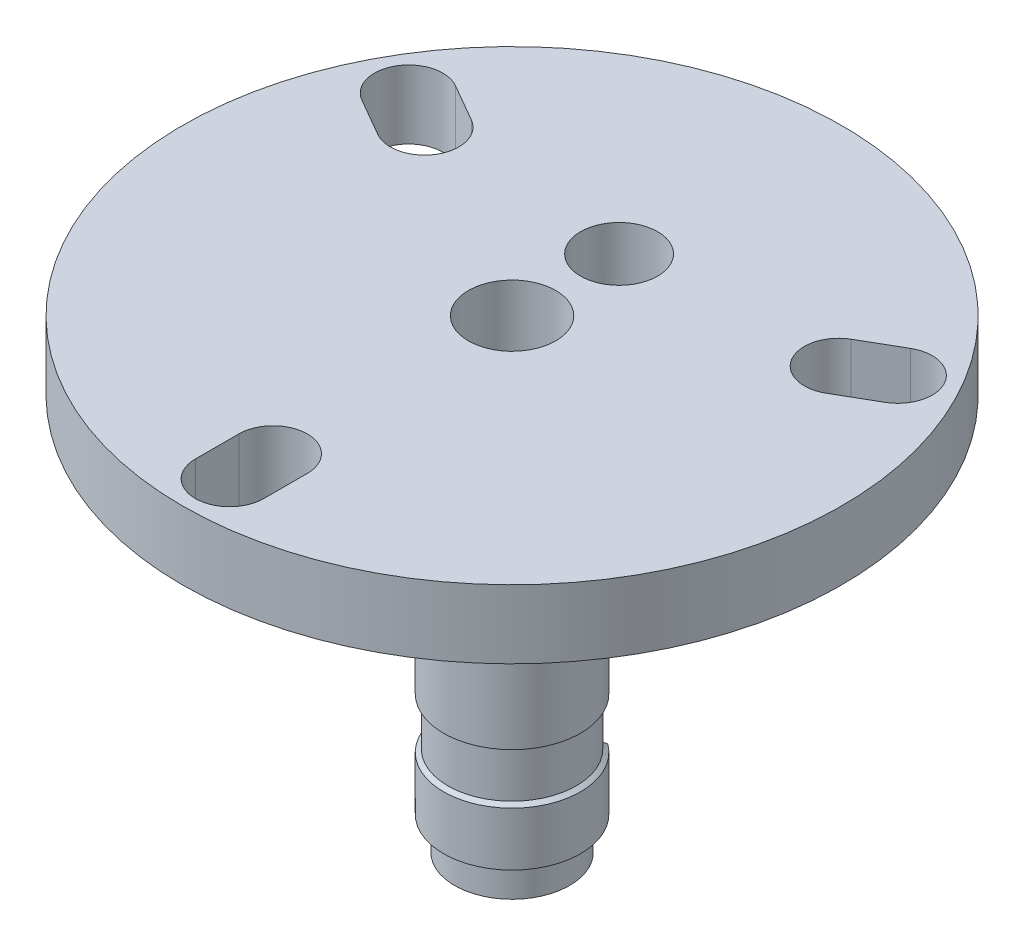
ISO-10303-21;
HEADER;
FILE_DESCRIPTION(('STEP AP214'),'2;1');
FILE_NAME('part.step','',(''),(''),'','','');
FILE_SCHEMA(('AUTOMOTIVE_DESIGN { 1 0 10303 214 1 1 1 1 }'));
ENDSEC;
DATA;
#1=APPLICATION_CONTEXT('core data for automotive mechanical design processes');
#2=APPLICATION_PROTOCOL_DEFINITION('international standard','automotive_design',2000,#1);
#3=PRODUCT_CONTEXT('',#1,'mechanical');
#4=PRODUCT('Part','Part','',(#3));
#5=PRODUCT_RELATED_PRODUCT_CATEGORY('part','',(#4));
#6=PRODUCT_DEFINITION_FORMATION('','',#4);
#7=PRODUCT_DEFINITION_CONTEXT('part definition',#1,'design');
#8=PRODUCT_DEFINITION('design','',#6,#7);
#9=PRODUCT_DEFINITION_SHAPE('','',#8);
#10=(LENGTH_UNIT() NAMED_UNIT(*) SI_UNIT(.MILLI.,.METRE.));
#11=(NAMED_UNIT(*) PLANE_ANGLE_UNIT() SI_UNIT($,.RADIAN.));
#12=(NAMED_UNIT(*) SI_UNIT($,.STERADIAN.) SOLID_ANGLE_UNIT());
#13=UNCERTAINTY_MEASURE_WITH_UNIT(LENGTH_MEASURE(1.E-05),#10,'distance_accuracy_value','');
#14=(GEOMETRIC_REPRESENTATION_CONTEXT(3) GLOBAL_UNCERTAINTY_ASSIGNED_CONTEXT((#13)) GLOBAL_UNIT_ASSIGNED_CONTEXT((#10,
#11,#12)) REPRESENTATION_CONTEXT('',''));
#15=CARTESIAN_POINT('',(0.,0.,0.));
#16=DIRECTION('',(0.,0.,1.));
#17=DIRECTION('',(1.,0.,0.));
#18=AXIS2_PLACEMENT_3D('',#15,#16,#17);
#19=CARTESIAN_POINT('',(0.,-65.6137084989847,0.));
#20=DIRECTION('',(0.,1.,0.));
#21=DIRECTION('',(0.,0.,1.));
#22=AXIS2_PLACEMENT_3D('',#19,#20,#21);
#23=CYLINDRICAL_SURFACE('',#22,4.);
#24=CARTESIAN_POINT('',(0.,-25.218,0.));
#25=DIRECTION('',(0.,-1.,0.));
#26=DIRECTION('',(0.,0.,-1.));
#27=AXIS2_PLACEMENT_3D('',#24,#25,#26);
#28=CIRCLE('',#27,4.);
#29=CARTESIAN_POINT('',(0.,-25.218,-4.));
#30=VERTEX_POINT('',#29);
#31=EDGE_CURVE('E436',#30,#30,#28,.T.);
#32=ORIENTED_EDGE('',*,*,#31,.F.);
#33=EDGE_LOOP('',(#32));
#34=FACE_BOUND('',#33,.T.);
#35=DIRECTION('',(0.,-1.,0.));
#36=VECTOR('',#35,1.);
#37=CARTESIAN_POINT('',(2.37479439899542,-20.5,-3.21875));
#38=LINE('',#37,#36);
#39=CARTESIAN_POINT('',(2.37479439899542,-23.,-3.21875));
#40=VERTEX_POINT('',#39);
#41=CARTESIAN_POINT('',(2.37479439899542,-22.0850622614629,-3.21875));
#42=VERTEX_POINT('',#41);
#43=EDGE_CURVE('E192',#40,#42,#38,.F.);
#44=ORIENTED_EDGE('',*,*,#43,.T.);
#45=CARTESIAN_POINT('',(0.,-22.0850622614629,0.));
#46=DIRECTION('',(0.,1.,0.));
#47=DIRECTION('',(0.,0.,1.));
#48=AXIS2_PLACEMENT_3D('',#45,#46,#47);
#49=CIRCLE('',#48,4.);
#50=CARTESIAN_POINT('',(-2.37479439899542,-22.0850622614629,-3.21875));
#51=VERTEX_POINT('',#50);
#52=EDGE_CURVE('E238',#42,#51,#49,.F.);
#53=ORIENTED_EDGE('',*,*,#52,.T.);
#54=DIRECTION('',(0.,-1.,0.));
#55=VECTOR('',#54,1.);
#56=CARTESIAN_POINT('',(-2.37479439899542,-20.5,-3.21875));
#57=LINE('',#56,#55);
#58=CARTESIAN_POINT('',(-2.37479439899542,-23.,-3.21875));
#59=VERTEX_POINT('',#58);
#60=EDGE_CURVE('E196',#51,#59,#57,.T.);
#61=ORIENTED_EDGE('',*,*,#60,.T.);
#62=CARTESIAN_POINT('',(0.,-23.,0.));
#63=DIRECTION('',(0.,1.,0.));
#64=DIRECTION('',(0.,0.,1.));
#65=AXIS2_PLACEMENT_3D('',#62,#63,#64);
#66=CIRCLE('',#65,4.);
#67=EDGE_CURVE('E193',#59,#40,#66,.F.);
#68=ORIENTED_EDGE('',*,*,#67,.T.);
#69=EDGE_LOOP('',(#44,#53,#61,#68));
#70=FACE_BOUND('',#69,.T.);
#71=ADVANCED_FACE('F37',(#34,#70),#23,.T.);
#72=CARTESIAN_POINT('',(0.,-4.,0.));
#73=DIRECTION('',(0.,1.,0.));
#74=DIRECTION('',(0.,0.,1.));
#75=AXIS2_PLACEMENT_3D('',#72,#73,#74);
#76=CIRCLE('',#75,4.);
#77=CARTESIAN_POINT('',(0.,-4.,-4.));
#78=VERTEX_POINT('',#77);
#79=EDGE_CURVE('E357',#78,#78,#76,.T.);
#80=ORIENTED_EDGE('',*,*,#79,.F.);
#81=EDGE_LOOP('',(#80));
#82=FACE_BOUND('',#81,.T.);
#83=CARTESIAN_POINT('',(-2.37479439899542,-15.9999999999999,-3.21875));
#84=VERTEX_POINT('',#83);
#85=CARTESIAN_POINT('',(-2.37479439899542,-19.125,-3.21875));
#86=VERTEX_POINT('',#85);
#87=EDGE_CURVE('E186',#84,#86,#57,.T.);
#88=ORIENTED_EDGE('',*,*,#87,.T.);
#89=CARTESIAN_POINT('',(0.,-19.125,0.));
#90=DIRECTION('',(0.,-1.,0.));
#91=DIRECTION('',(0.,0.,-1.));
#92=AXIS2_PLACEMENT_3D('',#89,#90,#91);
#93=CIRCLE('',#92,4.);
#94=CARTESIAN_POINT('',(2.37479439899542,-19.125,-3.21875));
#95=VERTEX_POINT('',#94);
#96=EDGE_CURVE('E174',#95,#86,#93,.T.);
#97=ORIENTED_EDGE('',*,*,#96,.F.);
#98=CARTESIAN_POINT('',(2.37479439899542,-15.9999999999999,-3.21875));
#99=VERTEX_POINT('',#98);
#100=EDGE_CURVE('E184',#95,#99,#38,.F.);
#101=ORIENTED_EDGE('',*,*,#100,.T.);
#102=CARTESIAN_POINT('',(0.,-15.9999999999999,0.));
#103=DIRECTION('',(0.,1.,0.));
#104=DIRECTION('',(0.,0.,1.));
#105=AXIS2_PLACEMENT_3D('',#102,#103,#104);
#106=CIRCLE('',#105,4.);
#107=EDGE_CURVE('E206',#99,#84,#106,.T.);
#108=ORIENTED_EDGE('',*,*,#107,.T.);
#109=EDGE_LOOP('',(#88,#97,#101,#108));
#110=FACE_BOUND('',#109,.T.);
#111=ADVANCED_FACE('F182',(#82,#110),#23,.T.);
#112=CARTESIAN_POINT('',(0.,-18.,-4.));
#113=DIRECTION('',(0.,-1.,0.));
#114=DIRECTION('',(0.,0.,-1.));
#115=AXIS2_PLACEMENT_3D('',#112,#113,#114);
#116=CYLINDRICAL_SURFACE('',#115,2.5);
#117=CARTESIAN_POINT('',(-2.37479439899542,-22.0850622614629,-3.21875));
#118=CARTESIAN_POINT('',(-2.36118707352224,-22.0561298472467,-3.17741941227018));
#119=CARTESIAN_POINT('',(-2.34656017175449,-22.0270759823098,-3.13657182569015));
#120=CARTESIAN_POINT('',(-2.31526721729532,-21.9687253540998,-3.05584265912631));
#121=CARTESIAN_POINT('',(-2.29860116482097,-21.9394285908526,-3.01596107903967));
#122=CARTESIAN_POINT('',(-2.2809155362691,-21.9100103769105,-2.9765625));
#123=B_SPLINE_CURVE_WITH_KNOTS('',3,(#117,#118,#119,#120,#121,#122),.UNSPECIFIED.,.F.,.F.,(4,2,
4),(0.,0.156650527840212,0.313301039005684),.UNSPECIFIED.);
#124=CARTESIAN_POINT('',(-2.2809155362691,-21.9100103769105,-2.9765625));
#125=VERTEX_POINT('',#124);
#126=EDGE_CURVE('E46',#51,#125,#123,.T.);
#127=ORIENTED_EDGE('',*,*,#126,.T.);
#128=DIRECTION('',(0.,-1.,0.));
#129=VECTOR('',#128,1.);
#130=CARTESIAN_POINT('',(-2.2809155362691,-20.5,-2.9765625));
#131=LINE('',#130,#129);
#132=CARTESIAN_POINT('',(-2.2809155362691,-19.125,-2.9765625));
#133=VERTEX_POINT('',#132);
#134=EDGE_CURVE('E52',#125,#133,#131,.F.);
#135=ORIENTED_EDGE('',*,*,#134,.T.);
#136=CARTESIAN_POINT('',(0.,-19.125,-4.));
#137=DIRECTION('',(0.,-1.,0.));
#138=DIRECTION('',(0.,0.,-1.));
#139=AXIS2_PLACEMENT_3D('',#136,#137,#138);
#140=CIRCLE('',#139,2.5);
#141=EDGE_CURVE('E179',#133,#86,#140,.T.);
#142=ORIENTED_EDGE('',*,*,#141,.T.);
#143=ORIENTED_EDGE('',*,*,#87,.F.);
#144=CARTESIAN_POINT('',(-2.37479439899542,-15.9999999999999,-3.21875));
#145=CARTESIAN_POINT('',(-2.35489754935274,-16.1661044695751,-3.15829197161496));
#146=CARTESIAN_POINT('',(-2.33288364707043,-16.3324213072463,-3.09912918413137));
#147=CARTESIAN_POINT('',(-2.28486567782906,-16.6652794424101,-2.9834790555469));
#148=CARTESIAN_POINT('',(-2.25886435708936,-16.8318205078121,-2.92698990783064));
#149=CARTESIAN_POINT('',(-2.20308787150949,-17.1651531048463,-2.81668956757807));
#150=CARTESIAN_POINT('',(-2.1733127459276,-17.3319446338551,-2.76287834719183));
#151=CARTESIAN_POINT('',(-2.11011909671268,-17.6658100823318,-2.6579334784613));
#152=CARTESIAN_POINT('',(-2.07669808779145,-17.832884117027,-2.60680169220069));
#153=CARTESIAN_POINT('',(-2.04154004758442,-18.,-2.55704669718351));
#154=B_SPLINE_CURVE_WITH_KNOTS('',3,(#144,#145,#146,#147,#148,#149,#150,#151,#152,#153),
.UNSPECIFIED.,.F.,.F.,(4,2,2,2,4),(0.,0.533618984122439,1.06687209055014,1.60011965008918,
2.13373300697153),.UNSPECIFIED.);
#155=CARTESIAN_POINT('',(-2.04154004758439,-18.,-2.55704669718347));
#156=VERTEX_POINT('',#155);
#157=EDGE_CURVE('E213',#84,#156,#154,.T.);
#158=ORIENTED_EDGE('',*,*,#157,.T.);
#159=CARTESIAN_POINT('',(0.,-18.,-4.));
#160=DIRECTION('',(0.,1.,0.));
#161=DIRECTION('',(0.,0.,1.));
#162=AXIS2_PLACEMENT_3D('',#159,#160,#161);
#163=CIRCLE('',#162,2.5);
#164=CARTESIAN_POINT('',(2.04154004758439,-18.,-2.55704669718347));
#165=VERTEX_POINT('',#164);
#166=EDGE_CURVE('E254',#156,#165,#163,.T.);
#167=ORIENTED_EDGE('',*,*,#166,.T.);
#168=CARTESIAN_POINT('',(2.04154004758439,-18.,-2.55704669718347));
#169=CARTESIAN_POINT('',(2.07669808779144,-17.832884117027,-2.60680169220067));
#170=CARTESIAN_POINT('',(2.11011909671267,-17.6658100823318,-2.65793347846129));
#171=CARTESIAN_POINT('',(2.17331274592761,-17.3319446338551,-2.76287834719183));
#172=CARTESIAN_POINT('',(2.2030878715095,-17.1651531048463,-2.81668956757807));
#173=CARTESIAN_POINT('',(2.25886435708936,-16.8318205078121,-2.92698990783064));
#174=CARTESIAN_POINT('',(2.28486567782906,-16.6652794424101,-2.9834790555469));
#175=CARTESIAN_POINT('',(2.33288364707043,-16.3324213072463,-3.09912918413137));
#176=CARTESIAN_POINT('',(2.35489754935275,-16.1661044695751,-3.15829197161496));
#177=CARTESIAN_POINT('',(2.37479439899542,-15.9999999999999,-3.21875000000001));
#178=B_SPLINE_CURVE_WITH_KNOTS('',3,(#168,#169,#170,#171,#172,#173,#174,#175,#176,#177),
.UNSPECIFIED.,.F.,.F.,(4,2,2,2,4),(0.,0.533613356882354,1.06686091642139,1.60011402284909,
2.13373300697153),.UNSPECIFIED.);
#179=EDGE_CURVE('E190',#165,#99,#178,.T.);
#180=ORIENTED_EDGE('',*,*,#179,.T.);
#181=ORIENTED_EDGE('',*,*,#100,.F.);
#182=CARTESIAN_POINT('',(2.2809155362691,-19.125,-2.9765625));
#183=VERTEX_POINT('',#182);
#184=EDGE_CURVE('E171',#95,#183,#140,.T.);
#185=ORIENTED_EDGE('',*,*,#184,.T.);
#186=DIRECTION('',(0.,-1.,0.));
#187=VECTOR('',#186,1.);
#188=CARTESIAN_POINT('',(2.2809155362691,-20.5,-2.9765625));
#189=LINE('',#188,#187);
#190=CARTESIAN_POINT('',(2.2809155362691,-21.9100103769105,-2.9765625));
#191=VERTEX_POINT('',#190);
#192=EDGE_CURVE('E60',#183,#191,#189,.T.);
#193=ORIENTED_EDGE('',*,*,#192,.T.);
#194=CARTESIAN_POINT('',(2.2809155362691,-21.9100103769105,-2.9765625));
#195=CARTESIAN_POINT('',(2.29860116482097,-21.9394285908526,-3.01596107903967));
#196=CARTESIAN_POINT('',(2.31526721729532,-21.9687253540998,-3.05584265912631));
#197=CARTESIAN_POINT('',(2.34656017175449,-22.0270759823098,-3.13657182569015));
#198=CARTESIAN_POINT('',(2.36118707352224,-22.0561298472467,-3.17741941227018));
#199=CARTESIAN_POINT('',(2.37479439899542,-22.0850622614629,-3.21875));
#200=B_SPLINE_CURVE_WITH_KNOTS('',3,(#194,#195,#196,#197,#198,#199),.UNSPECIFIED.,.F.,.F.,(4,2,
4),(0.,0.156650511165472,0.313301039005684),.UNSPECIFIED.);
#201=EDGE_CURVE('E233',#191,#42,#200,.T.);
#202=ORIENTED_EDGE('',*,*,#201,.T.);
#203=ORIENTED_EDGE('',*,*,#43,.F.);
#204=CARTESIAN_POINT('',(0.,-23.,-4.));
#205=DIRECTION('',(0.,1.,0.));
#206=DIRECTION('',(0.,0.,1.));
#207=AXIS2_PLACEMENT_3D('',#204,#205,#206);
#208=CIRCLE('',#207,2.5);
#209=EDGE_CURVE('E260',#59,#40,#208,.T.);
#210=ORIENTED_EDGE('',*,*,#209,.F.);
#211=ORIENTED_EDGE('',*,*,#60,.F.);
#212=EDGE_LOOP('',(#127,#135,#142,#143,#158,#167,#180,#181,#185,#193,#202,#203,#210,#211));
#213=FACE_BOUND('',#212,.T.);
#214=ADVANCED_FACE('F188',(#213),#116,.F.);
#215=CARTESIAN_POINT('',(0.,-27.15,0.));
#216=DIRECTION('',(0.,1.,0.));
#217=DIRECTION('',(0.,0.,1.));
#218=AXIS2_PLACEMENT_3D('',#215,#216,#217);
#219=PLANE('',#218);
#220=CARTESIAN_POINT('',(0.,-27.15,0.));
#221=DIRECTION('',(0.,1.,0.));
#222=DIRECTION('',(0.,0.,1.));
#223=AXIS2_PLACEMENT_3D('',#220,#221,#222);
#224=CIRCLE('',#223,0.8);
#225=CARTESIAN_POINT('',(0.,-27.15,0.799999999999997));
#226=VERTEX_POINT('',#225);
#227=EDGE_CURVE('E362',#226,#226,#224,.T.);
#228=ORIENTED_EDGE('',*,*,#227,.T.);
#229=EDGE_LOOP('',(#228));
#230=FACE_BOUND('',#229,.T.);
#231=CARTESIAN_POINT('',(0.,-27.15,0.));
#232=DIRECTION('',(0.,-1.,0.));
#233=DIRECTION('',(0.,0.,-1.));
#234=AXIS2_PLACEMENT_3D('',#231,#232,#233);
#235=CIRCLE('',#234,3.356);
#236=CARTESIAN_POINT('',(0.,-27.15,-3.356));
#237=VERTEX_POINT('',#236);
#238=EDGE_CURVE('E477',#237,#237,#235,.T.);
#239=ORIENTED_EDGE('',*,*,#238,.T.);
#240=EDGE_LOOP('',(#239));
#241=FACE_BOUND('',#240,.T.);
#242=ADVANCED_FACE('F224',(#230,#241),#219,.F.);
#243=CARTESIAN_POINT('',(0.,-4.,13.96));
#244=DIRECTION('',(0.,1.,0.));
#245=DIRECTION('',(0.,0.,1.));
#246=AXIS2_PLACEMENT_3D('',#243,#244,#245);
#247=CYLINDRICAL_SURFACE('',#246,2.);
#248=CARTESIAN_POINT('',(0.,0.,13.96));
#249=DIRECTION('',(0.,1.,0.));
#250=DIRECTION('',(0.,0.,1.));
#251=AXIS2_PLACEMENT_3D('',#248,#249,#250);
#252=CIRCLE('',#251,2.);
#253=CARTESIAN_POINT('',(2.,0.,13.96));
#254=VERTEX_POINT('',#253);
#255=CARTESIAN_POINT('',(-2.,0.,13.96));
#256=VERTEX_POINT('',#255);
#257=EDGE_CURVE('E380',#254,#256,#252,.T.);
#258=ORIENTED_EDGE('',*,*,#257,.T.);
#259=DIRECTION('',(0.,1.,0.));
#260=VECTOR('',#259,1.);
#261=CARTESIAN_POINT('',(-2.,-4.,13.96));
#262=LINE('',#261,#260);
#263=CARTESIAN_POINT('',(-2.,-4.,13.96));
#264=VERTEX_POINT('',#263);
#265=EDGE_CURVE('E198',#264,#256,#262,.T.);
#266=ORIENTED_EDGE('',*,*,#265,.F.);
#267=CARTESIAN_POINT('',(0.,-4.,13.96));
#268=DIRECTION('',(0.,1.,0.));
#269=DIRECTION('',(0.,0.,1.));
#270=AXIS2_PLACEMENT_3D('',#267,#268,#269);
#271=CIRCLE('',#270,2.);
#272=CARTESIAN_POINT('',(2.,-4.,13.96));
#273=VERTEX_POINT('',#272);
#274=EDGE_CURVE('E458',#273,#264,#271,.T.);
#275=ORIENTED_EDGE('',*,*,#274,.F.);
#276=DIRECTION('',(0.,1.,0.));
#277=VECTOR('',#276,1.);
#278=CARTESIAN_POINT('',(2.,-4.,13.96));
#279=LINE('',#278,#277);
#280=EDGE_CURVE('E400',#273,#254,#279,.T.);
#281=ORIENTED_EDGE('',*,*,#280,.T.);
#282=EDGE_LOOP('',(#258,#266,#275,#281));
#283=FACE_BOUND('',#282,.T.);
#284=ADVANCED_FACE('F303',(#283),#247,.F.);
#285=CARTESIAN_POINT('',(-1.99999999999999,-4.,0.));
#286=DIRECTION('',(1.,0.,0.));
#287=DIRECTION('',(0.,0.,-1.));
#288=AXIS2_PLACEMENT_3D('',#285,#286,#287);
#289=PLANE('',#288);
#290=DIRECTION('',(0.,0.,-1.));
#291=VECTOR('',#290,1.);
#292=CARTESIAN_POINT('',(-1.99999999999999,0.,0.));
#293=LINE('',#292,#291);
#294=CARTESIAN_POINT('',(-2.,0.,16.5));
#295=VERTEX_POINT('',#294);
#296=EDGE_CURVE('E387',#295,#256,#293,.T.);
#297=ORIENTED_EDGE('',*,*,#296,.F.);
#298=DIRECTION('',(0.,1.,0.));
#299=VECTOR('',#298,1.);
#300=CARTESIAN_POINT('',(-2.,-4.,16.5));
#301=LINE('',#300,#299);
#302=CARTESIAN_POINT('',(-2.,-4.,16.5));
#303=VERTEX_POINT('',#302);
#304=EDGE_CURVE('E395',#303,#295,#301,.T.);
#305=ORIENTED_EDGE('',*,*,#304,.F.);
#306=DIRECTION('',(0.,0.,-1.));
#307=VECTOR('',#306,1.);
#308=CARTESIAN_POINT('',(-1.99999999999999,-4.,0.));
#309=LINE('',#308,#307);
#310=EDGE_CURVE('E463',#303,#264,#309,.T.);
#311=ORIENTED_EDGE('',*,*,#310,.T.);
#312=ORIENTED_EDGE('',*,*,#265,.T.);
#313=EDGE_LOOP('',(#297,#305,#311,#312));
#314=FACE_BOUND('',#313,.T.);
#315=ADVANCED_FACE('F299',(#314),#289,.T.);
#316=CARTESIAN_POINT('',(0.,-4.,16.5));
#317=DIRECTION('',(0.,1.,0.));
#318=DIRECTION('',(0.,0.,1.));
#319=AXIS2_PLACEMENT_3D('',#316,#317,#318);
#320=CYLINDRICAL_SURFACE('',#319,2.);
#321=CARTESIAN_POINT('',(0.,0.,16.5));
#322=DIRECTION('',(0.,1.,0.));
#323=DIRECTION('',(0.,0.,1.));
#324=AXIS2_PLACEMENT_3D('',#321,#322,#323);
#325=CIRCLE('',#324,2.);
#326=CARTESIAN_POINT('',(2.,0.,16.5));
#327=VERTEX_POINT('',#326);
#328=EDGE_CURVE('E385',#295,#327,#325,.T.);
#329=ORIENTED_EDGE('',*,*,#328,.T.);
#330=DIRECTION('',(0.,1.,0.));
#331=VECTOR('',#330,1.);
#332=CARTESIAN_POINT('',(2.,-4.,16.5));
#333=LINE('',#332,#331);
#334=CARTESIAN_POINT('',(2.,-4.,16.5));
#335=VERTEX_POINT('',#334);
#336=EDGE_CURVE('E397',#335,#327,#333,.T.);
#337=ORIENTED_EDGE('',*,*,#336,.F.);
#338=CARTESIAN_POINT('',(0.,-4.,16.5));
#339=DIRECTION('',(0.,1.,0.));
#340=DIRECTION('',(0.,0.,1.));
#341=AXIS2_PLACEMENT_3D('',#338,#339,#340);
#342=CIRCLE('',#341,2.);
#343=EDGE_CURVE('E462',#303,#335,#342,.T.);
#344=ORIENTED_EDGE('',*,*,#343,.F.);
#345=ORIENTED_EDGE('',*,*,#304,.T.);
#346=EDGE_LOOP('',(#329,#337,#344,#345));
#347=FACE_BOUND('',#346,.T.);
#348=ADVANCED_FACE('F302',(#347),#320,.F.);
#349=CARTESIAN_POINT('',(0.999999999999998,-4.,1.73205080756888));
#350=DIRECTION('',(0.499999999999998,0.,0.86602540378444));
#351=DIRECTION('',(0.86602540378444,0.,-0.499999999999998));
#352=AXIS2_PLACEMENT_3D('',#349,#350,#351);
#353=PLANE('',#352);
#354=DIRECTION('',(0.86602540378444,0.,-0.499999999999998));
#355=VECTOR('',#354,1.);
#356=CARTESIAN_POINT('',(0.999999999999998,0.,1.73205080756888));
#357=LINE('',#356,#355);
#358=CARTESIAN_POINT('',(13.0897146368308,0.,-5.24794919243109));
#359=VERTEX_POINT('',#358);
#360=CARTESIAN_POINT('',(15.2894191624433,0.,-6.51794919243109));
#361=VERTEX_POINT('',#360);
#362=EDGE_CURVE('E371',#359,#361,#357,.T.);
#363=ORIENTED_EDGE('',*,*,#362,.T.);
#364=DIRECTION('',(0.,1.,0.));
#365=VECTOR('',#364,1.);
#366=CARTESIAN_POINT('',(15.2894191624433,-4.,-6.51794919243109));
#367=LINE('',#366,#365);
#368=CARTESIAN_POINT('',(15.2894191624433,-4.,-6.51794919243109));
#369=VERTEX_POINT('',#368);
#370=EDGE_CURVE('E403',#369,#361,#367,.T.);
#371=ORIENTED_EDGE('',*,*,#370,.F.);
#372=DIRECTION('',(0.86602540378444,0.,-0.499999999999998));
#373=VECTOR('',#372,1.);
#374=CARTESIAN_POINT('',(0.999999999999998,-4.,1.73205080756888));
#375=LINE('',#374,#373);
#376=CARTESIAN_POINT('',(13.0897146368308,-4.,-5.24794919243109));
#377=VERTEX_POINT('',#376);
#378=EDGE_CURVE('E449',#377,#369,#375,.T.);
#379=ORIENTED_EDGE('',*,*,#378,.F.);
#380=DIRECTION('',(0.,1.,0.));
#381=VECTOR('',#380,1.);
#382=CARTESIAN_POINT('',(13.0897146368308,-4.,-5.24794919243109));
#383=LINE('',#382,#381);
#384=EDGE_CURVE('E412',#377,#359,#383,.T.);
#385=ORIENTED_EDGE('',*,*,#384,.T.);
#386=EDGE_LOOP('',(#363,#371,#379,#385));
#387=FACE_BOUND('',#386,.T.);
#388=ADVANCED_FACE('F307',(#387),#353,.F.);
#389=CARTESIAN_POINT('',(14.2894191624433,-4.,-8.24999999999997));
#390=DIRECTION('',(0.,1.,0.));
#391=DIRECTION('',(0.,0.,1.));
#392=AXIS2_PLACEMENT_3D('',#389,#390,#391);
#393=CYLINDRICAL_SURFACE('',#392,2.);
#394=CARTESIAN_POINT('',(14.2894191624433,0.,-8.24999999999997));
#395=DIRECTION('',(0.,1.,0.));
#396=DIRECTION('',(0.,0.,1.));
#397=AXIS2_PLACEMENT_3D('',#394,#395,#396);
#398=CIRCLE('',#397,2.);
#399=CARTESIAN_POINT('',(13.2894191624433,0.,-9.98205080756885));
#400=VERTEX_POINT('',#399);
#401=EDGE_CURVE('E378',#361,#400,#398,.T.);
#402=ORIENTED_EDGE('',*,*,#401,.T.);
#403=DIRECTION('',(0.,1.,0.));
#404=VECTOR('',#403,1.);
#405=CARTESIAN_POINT('',(13.2894191624433,-4.,-9.98205080756885));
#406=LINE('',#405,#404);
#407=CARTESIAN_POINT('',(13.2894191624433,-4.,-9.98205080756885));
#408=VERTEX_POINT('',#407);
#409=EDGE_CURVE('E406',#408,#400,#406,.T.);
#410=ORIENTED_EDGE('',*,*,#409,.F.);
#411=CARTESIAN_POINT('',(14.2894191624433,-4.,-8.24999999999997));
#412=DIRECTION('',(0.,1.,0.));
#413=DIRECTION('',(0.,0.,1.));
#414=AXIS2_PLACEMENT_3D('',#411,#412,#413);
#415=CIRCLE('',#414,2.);
#416=EDGE_CURVE('E456',#369,#408,#415,.T.);
#417=ORIENTED_EDGE('',*,*,#416,.F.);
#418=ORIENTED_EDGE('',*,*,#370,.T.);
#419=EDGE_LOOP('',(#402,#410,#417,#418));
#420=FACE_BOUND('',#419,.T.);
#421=ADVANCED_FACE('F316',(#420),#393,.F.);
#422=CARTESIAN_POINT('',(-0.999999999999994,-4.,-1.73205080756887));
#423=DIRECTION('',(-0.499999999999998,0.,-0.86602540378444));
#424=DIRECTION('',(-0.86602540378444,0.,0.499999999999998));
#425=AXIS2_PLACEMENT_3D('',#422,#423,#424);
#426=PLANE('',#425);
#427=DIRECTION('',(-0.86602540378444,0.,0.499999999999998));
#428=VECTOR('',#427,1.);
#429=CARTESIAN_POINT('',(-0.999999999999994,0.,-1.73205080756887));
#430=LINE('',#429,#428);
#431=CARTESIAN_POINT('',(11.0897146368308,0.,-8.71205080756885));
#432=VERTEX_POINT('',#431);
#433=EDGE_CURVE('E376',#400,#432,#430,.T.);
#434=ORIENTED_EDGE('',*,*,#433,.T.);
#435=DIRECTION('',(0.,1.,0.));
#436=VECTOR('',#435,1.);
#437=CARTESIAN_POINT('',(11.0897146368308,-4.,-8.71205080756885));
#438=LINE('',#437,#436);
#439=CARTESIAN_POINT('',(11.0897146368308,-4.,-8.71205080756885));
#440=VERTEX_POINT('',#439);
#441=EDGE_CURVE('E409',#440,#432,#438,.T.);
#442=ORIENTED_EDGE('',*,*,#441,.F.);
#443=DIRECTION('',(-0.86602540378444,0.,0.499999999999998));
#444=VECTOR('',#443,1.);
#445=CARTESIAN_POINT('',(-0.999999999999994,-4.,-1.73205080756887));
#446=LINE('',#445,#444);
#447=EDGE_CURVE('E454',#408,#440,#446,.T.);
#448=ORIENTED_EDGE('',*,*,#447,.F.);
#449=ORIENTED_EDGE('',*,*,#409,.T.);
#450=EDGE_LOOP('',(#434,#442,#448,#449));
#451=FACE_BOUND('',#450,.T.);
#452=ADVANCED_FACE('F319',(#451),#426,.F.);
#453=CARTESIAN_POINT('',(0.999999999999991,-4.,-1.73205080756887));
#454=DIRECTION('',(-0.499999999999998,0.,0.86602540378444));
#455=DIRECTION('',(0.86602540378444,0.,0.499999999999998));
#456=AXIS2_PLACEMENT_3D('',#453,#454,#455);
#457=PLANE('',#456);
#458=DIRECTION('',(0.86602540378444,0.,0.499999999999998));
#459=VECTOR('',#458,1.);
#460=CARTESIAN_POINT('',(0.999999999999991,0.,-1.73205080756887));
#461=LINE('',#460,#459);
#462=CARTESIAN_POINT('',(-13.2894191624433,0.,-9.98205080756884));
#463=VERTEX_POINT('',#462);
#464=CARTESIAN_POINT('',(-11.0897146368308,0.,-8.71205080756885));
#465=VERTEX_POINT('',#464);
#466=EDGE_CURVE('E346',#463,#465,#461,.T.);
#467=ORIENTED_EDGE('',*,*,#466,.F.);
#468=DIRECTION('',(0.,1.,0.));
#469=VECTOR('',#468,1.);
#470=CARTESIAN_POINT('',(-13.2894191624433,-4.,-9.98205080756884));
#471=LINE('',#470,#469);
#472=CARTESIAN_POINT('',(-13.2894191624433,-4.,-9.98205080756884));
#473=VERTEX_POINT('',#472);
#474=EDGE_CURVE('E348',#473,#463,#471,.T.);
#475=ORIENTED_EDGE('',*,*,#474,.F.);
#476=DIRECTION('',(0.86602540378444,0.,0.499999999999998));
#477=VECTOR('',#476,1.);
#478=CARTESIAN_POINT('',(0.999999999999991,-4.,-1.73205080756887));
#479=LINE('',#478,#477);
#480=CARTESIAN_POINT('',(-11.0897146368308,-4.,-8.71205080756885));
#481=VERTEX_POINT('',#480);
#482=EDGE_CURVE('E393',#473,#481,#479,.T.);
#483=ORIENTED_EDGE('',*,*,#482,.T.);
#484=DIRECTION('',(0.,1.,0.));
#485=VECTOR('',#484,1.);
#486=CARTESIAN_POINT('',(-11.0897146368308,-4.,-8.71205080756885));
#487=LINE('',#486,#485);
#488=EDGE_CURVE('E351',#481,#465,#487,.T.);
#489=ORIENTED_EDGE('',*,*,#488,.T.);
#490=EDGE_LOOP('',(#467,#475,#483,#489));
#491=FACE_BOUND('',#490,.T.);
#492=ADVANCED_FACE('F323',(#491),#457,.T.);
#493=CARTESIAN_POINT('',(-14.2894191624433,-4.,-8.24999999999996));
#494=DIRECTION('',(0.,1.,0.));
#495=DIRECTION('',(0.,0.,1.));
#496=AXIS2_PLACEMENT_3D('',#493,#494,#495);
#497=CYLINDRICAL_SURFACE('',#496,2.00000000000001);
#498=CARTESIAN_POINT('',(-14.2894191624433,0.,-8.24999999999996));
#499=DIRECTION('',(0.,1.,0.));
#500=DIRECTION('',(0.,0.,1.));
#501=AXIS2_PLACEMENT_3D('',#498,#499,#500);
#502=CIRCLE('',#501,2.00000000000001);
#503=CARTESIAN_POINT('',(-15.2894191624433,0.,-6.51794919243108));
#504=VERTEX_POINT('',#503);
#505=EDGE_CURVE('E369',#463,#504,#502,.T.);
#506=ORIENTED_EDGE('',*,*,#505,.T.);
#507=DIRECTION('',(0.,1.,0.));
#508=VECTOR('',#507,1.);
#509=CARTESIAN_POINT('',(-15.2894191624433,-4.,-6.51794919243108));
#510=LINE('',#509,#508);
#511=CARTESIAN_POINT('',(-15.2894191624433,-4.,-6.51794919243108));
#512=VERTEX_POINT('',#511);
#513=EDGE_CURVE('E416',#512,#504,#510,.T.);
#514=ORIENTED_EDGE('',*,*,#513,.F.);
#515=CARTESIAN_POINT('',(-14.2894191624433,-4.,-8.24999999999996));
#516=DIRECTION('',(0.,1.,0.));
#517=DIRECTION('',(0.,0.,1.));
#518=AXIS2_PLACEMENT_3D('',#515,#516,#517);
#519=CIRCLE('',#518,2.00000000000001);
#520=EDGE_CURVE('E447',#473,#512,#519,.T.);
#521=ORIENTED_EDGE('',*,*,#520,.F.);
#522=ORIENTED_EDGE('',*,*,#474,.T.);
#523=EDGE_LOOP('',(#506,#514,#521,#522));
#524=FACE_BOUND('',#523,.T.);
#525=ADVANCED_FACE('F331',(#524),#497,.F.);
#526=CARTESIAN_POINT('',(-0.999999999999999,-4.,1.73205080756888));
#527=DIRECTION('',(-0.499999999999998,0.,0.86602540378444));
#528=DIRECTION('',(0.86602540378444,0.,0.499999999999998));
#529=AXIS2_PLACEMENT_3D('',#526,#527,#528);
#530=PLANE('',#529);
#531=DIRECTION('',(0.86602540378444,0.,0.499999999999998));
#532=VECTOR('',#531,1.);
#533=CARTESIAN_POINT('',(-0.999999999999999,0.,1.73205080756888));
#534=LINE('',#533,#532);
#535=CARTESIAN_POINT('',(-13.0897146368308,0.,-5.24794919243109));
#536=VERTEX_POINT('',#535);
#537=EDGE_CURVE('E359',#504,#536,#534,.T.);
#538=ORIENTED_EDGE('',*,*,#537,.T.);
#539=DIRECTION('',(0.,1.,0.));
#540=VECTOR('',#539,1.);
#541=CARTESIAN_POINT('',(-13.0897146368308,-4.,-5.24794919243109));
#542=LINE('',#541,#540);
#543=CARTESIAN_POINT('',(-13.0897146368308,-4.,-5.24794919243109));
#544=VERTEX_POINT('',#543);
#545=EDGE_CURVE('E419',#544,#536,#542,.T.);
#546=ORIENTED_EDGE('',*,*,#545,.F.);
#547=DIRECTION('',(0.86602540378444,0.,0.499999999999998));
#548=VECTOR('',#547,1.);
#549=CARTESIAN_POINT('',(-0.999999999999999,-4.,1.73205080756888));
#550=LINE('',#549,#548);
#551=EDGE_CURVE('E445',#512,#544,#550,.T.);
#552=ORIENTED_EDGE('',*,*,#551,.F.);
#553=ORIENTED_EDGE('',*,*,#513,.T.);
#554=EDGE_LOOP('',(#538,#546,#552,#553));
#555=FACE_BOUND('',#554,.T.);
#556=ADVANCED_FACE('F297',(#555),#530,.F.);
#557=CARTESIAN_POINT('',(0.,-4.,0.));
#558=DIRECTION('',(0.,1.,0.));
#559=DIRECTION('',(0.,0.,1.));
#560=AXIS2_PLACEMENT_3D('',#557,#558,#559);
#561=CYLINDRICAL_SURFACE('',#560,19.25);
#562=CARTESIAN_POINT('',(0.,-4.,0.));
#563=DIRECTION('',(0.,1.,0.));
#564=DIRECTION('',(0.,0.,1.));
#565=AXIS2_PLACEMENT_3D('',#562,#563,#564);
#566=CIRCLE('',#565,19.25);
#567=CARTESIAN_POINT('',(0.,-4.,19.25));
#568=VERTEX_POINT('',#567);
#569=EDGE_CURVE('E365',#568,#568,#566,.T.);
#570=ORIENTED_EDGE('',*,*,#569,.T.);
#571=EDGE_LOOP('',(#570));
#572=FACE_BOUND('',#571,.T.);
#573=CARTESIAN_POINT('',(0.,0.,0.));
#574=DIRECTION('',(0.,1.,0.));
#575=DIRECTION('',(0.,0.,1.));
#576=AXIS2_PLACEMENT_3D('',#573,#574,#575);
#577=CIRCLE('',#576,19.25);
#578=CARTESIAN_POINT('',(0.,0.,19.25));
#579=VERTEX_POINT('',#578);
#580=EDGE_CURVE('E390',#579,#579,#577,.T.);
#581=ORIENTED_EDGE('',*,*,#580,.F.);
#582=EDGE_LOOP('',(#581));
#583=FACE_BOUND('',#582,.T.);
#584=ADVANCED_FACE('F293',(#572,#583),#561,.T.);
#585=CARTESIAN_POINT('',(1.99999999999999,-4.,0.));
#586=DIRECTION('',(1.,0.,0.));
#587=DIRECTION('',(0.,0.,-1.));
#588=AXIS2_PLACEMENT_3D('',#585,#586,#587);
#589=PLANE('',#588);
#590=DIRECTION('',(0.,0.,-1.));
#591=VECTOR('',#590,1.);
#592=CARTESIAN_POINT('',(1.99999999999999,0.,0.));
#593=LINE('',#592,#591);
#594=EDGE_CURVE('E383',#327,#254,#593,.T.);
#595=ORIENTED_EDGE('',*,*,#594,.T.);
#596=ORIENTED_EDGE('',*,*,#280,.F.);
#597=DIRECTION('',(0.,0.,-1.));
#598=VECTOR('',#597,1.);
#599=CARTESIAN_POINT('',(1.99999999999999,-4.,0.));
#600=LINE('',#599,#598);
#601=EDGE_CURVE('E460',#335,#273,#600,.T.);
#602=ORIENTED_EDGE('',*,*,#601,.F.);
#603=ORIENTED_EDGE('',*,*,#336,.T.);
#604=EDGE_LOOP('',(#595,#596,#602,#603));
#605=FACE_BOUND('',#604,.T.);
#606=ADVANCED_FACE('F296',(#605),#589,.F.);
#607=CARTESIAN_POINT('',(12.0897146368308,-4.,-6.97999999999997));
#608=DIRECTION('',(0.,1.,0.));
#609=DIRECTION('',(0.,0.,1.));
#610=AXIS2_PLACEMENT_3D('',#607,#608,#609);
#611=CYLINDRICAL_SURFACE('',#610,2.);
#612=CARTESIAN_POINT('',(12.0897146368308,0.,-6.97999999999997));
#613=DIRECTION('',(0.,1.,0.));
#614=DIRECTION('',(0.,0.,1.));
#615=AXIS2_PLACEMENT_3D('',#612,#613,#614);
#616=CIRCLE('',#615,2.);
#617=EDGE_CURVE('E374',#432,#359,#616,.T.);
#618=ORIENTED_EDGE('',*,*,#617,.T.);
#619=ORIENTED_EDGE('',*,*,#384,.F.);
#620=CARTESIAN_POINT('',(12.0897146368308,-4.,-6.97999999999997));
#621=DIRECTION('',(0.,1.,0.));
#622=DIRECTION('',(0.,0.,1.));
#623=AXIS2_PLACEMENT_3D('',#620,#621,#622);
#624=CIRCLE('',#623,2.);
#625=EDGE_CURVE('E452',#440,#377,#624,.T.);
#626=ORIENTED_EDGE('',*,*,#625,.F.);
#627=ORIENTED_EDGE('',*,*,#441,.T.);
#628=EDGE_LOOP('',(#618,#619,#626,#627));
#629=FACE_BOUND('',#628,.T.);
#630=ADVANCED_FACE('F311',(#629),#611,.F.);
#631=CARTESIAN_POINT('',(-12.0897146368308,-4.,-6.97999999999997));
#632=DIRECTION('',(0.,1.,0.));
#633=DIRECTION('',(0.,0.,1.));
#634=AXIS2_PLACEMENT_3D('',#631,#632,#633);
#635=CYLINDRICAL_SURFACE('',#634,2.00000000000001);
#636=CARTESIAN_POINT('',(-12.0897146368308,0.,-6.97999999999997));
#637=DIRECTION('',(0.,1.,0.));
#638=DIRECTION('',(0.,0.,1.));
#639=AXIS2_PLACEMENT_3D('',#636,#637,#638);
#640=CIRCLE('',#639,2.00000000000001);
#641=EDGE_CURVE('E356',#536,#465,#640,.T.);
#642=ORIENTED_EDGE('',*,*,#641,.T.);
#643=ORIENTED_EDGE('',*,*,#488,.F.);
#644=CARTESIAN_POINT('',(-12.0897146368308,-4.,-6.97999999999997));
#645=DIRECTION('',(0.,1.,0.));
#646=DIRECTION('',(0.,0.,1.));
#647=AXIS2_PLACEMENT_3D('',#644,#645,#646);
#648=CIRCLE('',#647,2.00000000000001);
#649=EDGE_CURVE('E443',#544,#481,#648,.T.);
#650=ORIENTED_EDGE('',*,*,#649,.F.);
#651=ORIENTED_EDGE('',*,*,#545,.T.);
#652=EDGE_LOOP('',(#642,#643,#650,#651));
#653=FACE_BOUND('',#652,.T.);
#654=ADVANCED_FACE('F287',(#653),#635,.F.);
#655=CARTESIAN_POINT('',(0.,-4.,0.));
#656=DIRECTION('',(0.,1.,0.));
#657=DIRECTION('',(0.,0.,1.));
#658=AXIS2_PLACEMENT_3D('',#655,#656,#657);
#659=PLANE('',#658);
#660=ORIENTED_EDGE('',*,*,#482,.F.);
#661=ORIENTED_EDGE('',*,*,#520,.T.);
#662=ORIENTED_EDGE('',*,*,#551,.T.);
#663=ORIENTED_EDGE('',*,*,#649,.T.);
#664=EDGE_LOOP('',(#660,#661,#662,#663));
#665=FACE_BOUND('',#664,.T.);
#666=ORIENTED_EDGE('',*,*,#378,.T.);
#667=ORIENTED_EDGE('',*,*,#416,.T.);
#668=ORIENTED_EDGE('',*,*,#447,.T.);
#669=ORIENTED_EDGE('',*,*,#625,.T.);
#670=EDGE_LOOP('',(#666,#667,#668,#669));
#671=FACE_BOUND('',#670,.T.);
#672=ORIENTED_EDGE('',*,*,#274,.T.);
#673=ORIENTED_EDGE('',*,*,#310,.F.);
#674=ORIENTED_EDGE('',*,*,#343,.T.);
#675=ORIENTED_EDGE('',*,*,#601,.T.);
#676=EDGE_LOOP('',(#672,#673,#674,#675));
#677=FACE_BOUND('',#676,.T.);
#678=ORIENTED_EDGE('',*,*,#569,.F.);
#679=EDGE_LOOP('',(#678));
#680=FACE_BOUND('',#679,.T.);
#681=ORIENTED_EDGE('',*,*,#79,.T.);
#682=CARTESIAN_POINT('',(0.,-4.,-6.25));
#683=DIRECTION('',(0.,-1.,0.));
#684=DIRECTION('',(0.,0.,-1.));
#685=AXIS2_PLACEMENT_3D('',#682,#683,#684);
#686=CIRCLE('',#685,2.25);
#687=EDGE_CURVE('E259',#78,#78,#686,.T.);
#688=ORIENTED_EDGE('',*,*,#687,.F.);
#689=EDGE_LOOP('',(#681,#688));
#690=FACE_BOUND('',#689,.T.);
#691=ADVANCED_FACE('F283',(#665,#671,#677,#680,#690),#659,.F.);
#692=CARTESIAN_POINT('',(0.,0.,0.));
#693=DIRECTION('',(0.,1.,0.));
#694=DIRECTION('',(0.,0.,1.));
#695=AXIS2_PLACEMENT_3D('',#692,#693,#694);
#696=PLANE('',#695);
#697=CARTESIAN_POINT('',(0.,0.,-6.25));
#698=DIRECTION('',(0.,-1.,0.));
#699=DIRECTION('',(0.,0.,-1.));
#700=AXIS2_PLACEMENT_3D('',#697,#698,#699);
#701=CIRCLE('',#700,2.25);
#702=CARTESIAN_POINT('',(0.,0.,-8.5));
#703=VERTEX_POINT('',#702);
#704=EDGE_CURVE('E474',#703,#703,#701,.T.);
#705=ORIENTED_EDGE('',*,*,#704,.T.);
#706=EDGE_LOOP('',(#705));
#707=FACE_BOUND('',#706,.T.);
#708=CARTESIAN_POINT('',(0.,0.,0.));
#709=DIRECTION('',(0.,1.,0.));
#710=DIRECTION('',(0.,0.,1.));
#711=AXIS2_PLACEMENT_3D('',#708,#709,#710);
#712=CIRCLE('',#711,2.55);
#713=CARTESIAN_POINT('',(0.,0.,2.55));
#714=VERTEX_POINT('',#713);
#715=EDGE_CURVE('E425',#714,#714,#712,.T.);
#716=ORIENTED_EDGE('',*,*,#715,.F.);
#717=EDGE_LOOP('',(#716));
#718=FACE_BOUND('',#717,.T.);
#719=ORIENTED_EDGE('',*,*,#466,.T.);
#720=ORIENTED_EDGE('',*,*,#641,.F.);
#721=ORIENTED_EDGE('',*,*,#537,.F.);
#722=ORIENTED_EDGE('',*,*,#505,.F.);
#723=EDGE_LOOP('',(#719,#720,#721,#722));
#724=FACE_BOUND('',#723,.T.);
#725=ORIENTED_EDGE('',*,*,#362,.F.);
#726=ORIENTED_EDGE('',*,*,#617,.F.);
#727=ORIENTED_EDGE('',*,*,#433,.F.);
#728=ORIENTED_EDGE('',*,*,#401,.F.);
#729=EDGE_LOOP('',(#725,#726,#727,#728));
#730=FACE_BOUND('',#729,.T.);
#731=ORIENTED_EDGE('',*,*,#257,.F.);
#732=ORIENTED_EDGE('',*,*,#594,.F.);
#733=ORIENTED_EDGE('',*,*,#328,.F.);
#734=ORIENTED_EDGE('',*,*,#296,.T.);
#735=EDGE_LOOP('',(#731,#732,#733,#734));
#736=FACE_BOUND('',#735,.T.);
#737=ORIENTED_EDGE('',*,*,#580,.T.);
#738=EDGE_LOOP('',(#737));
#739=FACE_BOUND('',#738,.T.);
#740=ADVANCED_FACE('F286',(#707,#718,#724,#730,#736,#739),#696,.T.);
#741=CARTESIAN_POINT('',(0.,0.,0.));
#742=DIRECTION('',(0.,1.,0.));
#743=DIRECTION('',(0.,0.,1.));
#744=AXIS2_PLACEMENT_3D('',#741,#742,#743);
#745=CYLINDRICAL_SURFACE('',#744,0.8);
#746=CARTESIAN_POINT('',(0.,-25.15,0.));
#747=DIRECTION('',(0.,1.,0.));
#748=DIRECTION('',(0.,0.,1.));
#749=AXIS2_PLACEMENT_3D('',#746,#747,#748);
#750=CIRCLE('',#749,0.8);
#751=CARTESIAN_POINT('',(0.,-25.15,0.799999999999997));
#752=VERTEX_POINT('',#751);
#753=EDGE_CURVE('E424',#752,#752,#750,.T.);
#754=ORIENTED_EDGE('',*,*,#753,.T.);
#755=EDGE_LOOP('',(#754));
#756=FACE_BOUND('',#755,.T.);
#757=ORIENTED_EDGE('',*,*,#227,.F.);
#758=EDGE_LOOP('',(#757));
#759=FACE_BOUND('',#758,.T.);
#760=ADVANCED_FACE('F291',(#756,#759),#745,.F.);
#761=CARTESIAN_POINT('',(0.,0.,0.));
#762=DIRECTION('',(0.,1.,0.));
#763=DIRECTION('',(0.,0.,1.));
#764=AXIS2_PLACEMENT_3D('',#761,#762,#763);
#765=CONICAL_SURFACE('',#764,1.,0.00795211865750102);
#766=CARTESIAN_POINT('',(0.,-6.45227376256945,0.));
#767=DIRECTION('',(0.,1.,0.));
#768=DIRECTION('',(0.,0.,1.));
#769=AXIS2_PLACEMENT_3D('',#766,#767,#768);
#770=CIRCLE('',#769,0.948689671868235);
#771=CARTESIAN_POINT('',(0.,-6.45227376256945,0.948689671868235));
#772=VERTEX_POINT('',#771);
#773=EDGE_CURVE('E422',#772,#772,#770,.T.);
#774=ORIENTED_EDGE('',*,*,#773,.T.);
#775=EDGE_LOOP('',(#774));
#776=FACE_BOUND('',#775,.T.);
#777=ORIENTED_EDGE('',*,*,#753,.F.);
#778=EDGE_LOOP('',(#777));
#779=FACE_BOUND('',#778,.T.);
#780=ADVANCED_FACE('F504',(#776,#779),#765,.F.);
#781=CARTESIAN_POINT('',(0.,-5.52775681356644,0.));
#782=DIRECTION('',(0.,1.,0.));
#783=DIRECTION('',(0.,0.,1.));
#784=AXIS2_PLACEMENT_3D('',#781,#782,#783);
#785=CONICAL_SURFACE('',#784,2.55,1.04719755119659);
#786=CARTESIAN_POINT('',(0.,-5.52775681356644,0.));
#787=DIRECTION('',(0.,1.,0.));
#788=DIRECTION('',(0.,0.,1.));
#789=AXIS2_PLACEMENT_3D('',#786,#787,#788);
#790=CIRCLE('',#789,2.55);
#791=CARTESIAN_POINT('',(0.,-5.52775681356644,2.55));
#792=VERTEX_POINT('',#791);
#793=EDGE_CURVE('E431',#792,#792,#790,.T.);
#794=ORIENTED_EDGE('',*,*,#793,.T.);
#795=EDGE_LOOP('',(#794));
#796=FACE_BOUND('',#795,.T.);
#797=ORIENTED_EDGE('',*,*,#773,.F.);
#798=EDGE_LOOP('',(#797));
#799=FACE_BOUND('',#798,.T.);
#800=ADVANCED_FACE('F498',(#796,#799),#785,.F.);
#801=CARTESIAN_POINT('',(0.,0.,0.));
#802=DIRECTION('',(0.,1.,0.));
#803=DIRECTION('',(0.,0.,1.));
#804=AXIS2_PLACEMENT_3D('',#801,#802,#803);
#805=CYLINDRICAL_SURFACE('',#804,2.55);
#806=ORIENTED_EDGE('',*,*,#793,.F.);
#807=EDGE_LOOP('',(#806));
#808=FACE_BOUND('',#807,.T.);
#809=ORIENTED_EDGE('',*,*,#715,.T.);
#810=EDGE_LOOP('',(#809));
#811=FACE_BOUND('',#810,.T.);
#812=ADVANCED_FACE('F490',(#808,#811),#805,.F.);
#813=CARTESIAN_POINT('',(0.,-25.218,0.));
#814=DIRECTION('',(0.,-1.,0.));
#815=DIRECTION('',(0.,0.,-1.));
#816=AXIS2_PLACEMENT_3D('',#813,#814,#815);
#817=PLANE('',#816);
#818=CARTESIAN_POINT('',(0.,-25.218,0.));
#819=DIRECTION('',(0.,-1.,0.));
#820=DIRECTION('',(0.,0.,-1.));
#821=AXIS2_PLACEMENT_3D('',#818,#819,#820);
#822=CIRCLE('',#821,3.356);
#823=CARTESIAN_POINT('',(0.,-25.218,-3.356));
#824=VERTEX_POINT('',#823);
#825=EDGE_CURVE('E481',#824,#824,#822,.T.);
#826=ORIENTED_EDGE('',*,*,#825,.F.);
#827=EDGE_LOOP('',(#826));
#828=FACE_BOUND('',#827,.T.);
#829=ORIENTED_EDGE('',*,*,#31,.T.);
#830=EDGE_LOOP('',(#829));
#831=FACE_BOUND('',#830,.T.);
#832=ADVANCED_FACE('F487',(#828,#831),#817,.T.);
#833=CARTESIAN_POINT('',(0.,-25.218,0.));
#834=DIRECTION('',(0.,-1.,0.));
#835=DIRECTION('',(0.,0.,-1.));
#836=AXIS2_PLACEMENT_3D('',#833,#834,#835);
#837=CYLINDRICAL_SURFACE('',#836,3.356);
#838=ORIENTED_EDGE('',*,*,#825,.T.);
#839=EDGE_LOOP('',(#838));
#840=FACE_BOUND('',#839,.T.);
#841=ORIENTED_EDGE('',*,*,#238,.F.);
#842=EDGE_LOOP('',(#841));
#843=FACE_BOUND('',#842,.T.);
#844=ADVANCED_FACE('F489',(#840,#843),#837,.T.);
#845=CARTESIAN_POINT('',(0.,0.,-6.25));
#846=DIRECTION('',(0.,-1.,0.));
#847=DIRECTION('',(0.,0.,-1.));
#848=AXIS2_PLACEMENT_3D('',#845,#846,#847);
#849=CYLINDRICAL_SURFACE('',#848,2.25);
#850=ORIENTED_EDGE('',*,*,#704,.F.);
#851=EDGE_LOOP('',(#850));
#852=FACE_BOUND('',#851,.T.);
#853=ORIENTED_EDGE('',*,*,#687,.T.);
#854=EDGE_LOOP('',(#853));
#855=FACE_BOUND('',#854,.T.);
#856=ADVANCED_FACE('F227',(#852,#855),#849,.F.);
#857=CARTESIAN_POINT('',(0.,-18.,-4.));
#858=DIRECTION('',(0.,1.,0.));
#859=DIRECTION('',(0.,0.,1.));
#860=AXIS2_PLACEMENT_3D('',#857,#858,#859);
#861=PLANE('',#860);
#862=ORIENTED_EDGE('',*,*,#166,.F.);
#863=CARTESIAN_POINT('',(0.,-18.,0.));
#864=DIRECTION('',(0.,1.,0.));
#865=DIRECTION('',(0.,0.,1.));
#866=AXIS2_PLACEMENT_3D('',#863,#864,#865);
#867=CIRCLE('',#866,3.27205953146757);
#868=EDGE_CURVE('E203',#156,#165,#867,.F.);
#869=ORIENTED_EDGE('',*,*,#868,.T.);
#870=EDGE_LOOP('',(#862,#869));
#871=FACE_BOUND('',#870,.T.);
#872=ADVANCED_FACE('F258',(#871),#861,.F.);
#873=CARTESIAN_POINT('',(0.,-23.,-4.));
#874=DIRECTION('',(0.,1.,0.));
#875=DIRECTION('',(0.,0.,1.));
#876=AXIS2_PLACEMENT_3D('',#873,#874,#875);
#877=PLANE('',#876);
#878=ORIENTED_EDGE('',*,*,#209,.T.);
#879=ORIENTED_EDGE('',*,*,#67,.F.);
#880=EDGE_LOOP('',(#878,#879));
#881=FACE_BOUND('',#880,.T.);
#882=ADVANCED_FACE('F225',(#881),#877,.T.);
#883=CARTESIAN_POINT('',(0.,-18.,0.));
#884=DIRECTION('',(0.,1.,0.));
#885=DIRECTION('',(0.,0.,1.));
#886=AXIS2_PLACEMENT_3D('',#883,#884,#885);
#887=CONICAL_SURFACE('',#886,3.27205953146757,0.349065850398863);
#888=ORIENTED_EDGE('',*,*,#157,.F.);
#889=ORIENTED_EDGE('',*,*,#107,.F.);
#890=ORIENTED_EDGE('',*,*,#179,.F.);
#891=ORIENTED_EDGE('',*,*,#868,.F.);
#892=EDGE_LOOP('',(#888,#889,#890,#891));
#893=FACE_BOUND('',#892,.T.);
#894=ADVANCED_FACE('F217',(#893),#887,.T.);
#895=CARTESIAN_POINT('',(0.,-27.15,0.));
#896=DIRECTION('',(0.,-1.,0.));
#897=DIRECTION('',(0.,0.,-1.));
#898=AXIS2_PLACEMENT_3D('',#895,#896,#897);
#899=CYLINDRICAL_SURFACE('',#898,3.75);
#900=ORIENTED_EDGE('',*,*,#134,.F.);
#901=CARTESIAN_POINT('',(0.,-21.9100103769105,0.));
#902=DIRECTION('',(0.,-1.,0.));
#903=DIRECTION('',(0.,0.,-1.));
#904=AXIS2_PLACEMENT_3D('',#901,#902,#903);
#905=CIRCLE('',#904,3.75);
#906=EDGE_CURVE('E12',#125,#191,#905,.F.);
#907=ORIENTED_EDGE('',*,*,#906,.T.);
#908=ORIENTED_EDGE('',*,*,#192,.F.);
#909=CARTESIAN_POINT('',(0.,-19.125,0.));
#910=DIRECTION('',(0.,-1.,0.));
#911=DIRECTION('',(0.,0.,-1.));
#912=AXIS2_PLACEMENT_3D('',#909,#910,#911);
#913=CIRCLE('',#912,3.75);
#914=EDGE_CURVE('E176',#183,#133,#913,.T.);
#915=ORIENTED_EDGE('',*,*,#914,.T.);
#916=EDGE_LOOP('',(#900,#907,#908,#915));
#917=FACE_BOUND('',#916,.T.);
#918=ADVANCED_FACE('F250',(#917),#899,.T.);
#919=CARTESIAN_POINT('',(0.,-19.125,4.));
#920=DIRECTION('',(0.,-1.,0.));
#921=DIRECTION('',(0.,0.,-1.));
#922=AXIS2_PLACEMENT_3D('',#919,#920,#921);
#923=PLANE('',#922);
#924=ORIENTED_EDGE('',*,*,#96,.T.);
#925=ORIENTED_EDGE('',*,*,#141,.F.);
#926=ORIENTED_EDGE('',*,*,#914,.F.);
#927=ORIENTED_EDGE('',*,*,#184,.F.);
#928=EDGE_LOOP('',(#924,#925,#926,#927));
#929=FACE_BOUND('',#928,.T.);
#930=ADVANCED_FACE('F173',(#929),#923,.T.);
#931=CARTESIAN_POINT('',(0.,-22.0850622614629,0.));
#932=DIRECTION('',(0.,-1.,0.));
#933=DIRECTION('',(0.,0.,-1.));
#934=AXIS2_PLACEMENT_3D('',#931,#932,#933);
#935=CONICAL_SURFACE('',#934,4.,0.959931088596873);
#936=ORIENTED_EDGE('',*,*,#201,.F.);
#937=ORIENTED_EDGE('',*,*,#906,.F.);
#938=ORIENTED_EDGE('',*,*,#126,.F.);
#939=ORIENTED_EDGE('',*,*,#52,.F.);
#940=EDGE_LOOP('',(#936,#937,#938,#939));
#941=FACE_BOUND('',#940,.T.);
#942=ADVANCED_FACE('F39',(#941),#935,.T.);
#943=CLOSED_SHELL('',(#71,#111,#214,#242,#284,#315,#348,#388,#421,#452,#492,#525,#556,#584,#606,
#630,#654,#691,#740,#760,#780,#800,#812,#832,#844,#856,#872,#882,#894,#918,#930,#942));
#944=MANIFOLD_SOLID_BREP('B2',#943);
#945=ADVANCED_BREP_SHAPE_REPRESENTATION('',(#18,#944),#14);
#946=SHAPE_DEFINITION_REPRESENTATION(#9,#945);
ENDSEC;
END-ISO-10303-21;
